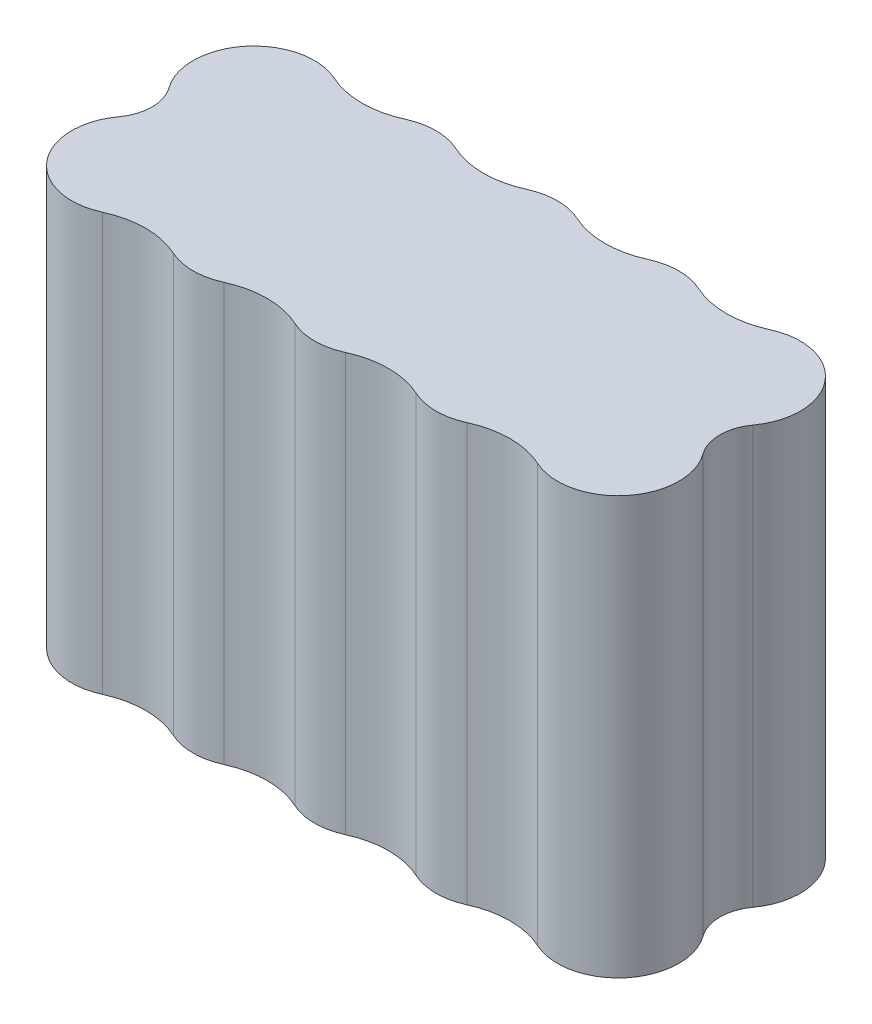
ISO-10303-21;
HEADER;
FILE_DESCRIPTION(('STEP AP214'),'2;1');
FILE_NAME('part.step','',(''),(''),'','','');
FILE_SCHEMA(('AUTOMOTIVE_DESIGN { 1 0 10303 214 1 1 1 1 }'));
ENDSEC;
DATA;
#1=APPLICATION_CONTEXT('core data for automotive mechanical design processes');
#2=APPLICATION_PROTOCOL_DEFINITION('international standard','automotive_design',2000,#1);
#3=PRODUCT_CONTEXT('',#1,'mechanical');
#4=PRODUCT('Part','Part','',(#3));
#5=PRODUCT_RELATED_PRODUCT_CATEGORY('part','',(#4));
#6=PRODUCT_DEFINITION_FORMATION('','',#4);
#7=PRODUCT_DEFINITION_CONTEXT('part definition',#1,'design');
#8=PRODUCT_DEFINITION('design','',#6,#7);
#9=PRODUCT_DEFINITION_SHAPE('','',#8);
#10=(LENGTH_UNIT() NAMED_UNIT(*) SI_UNIT(.MILLI.,.METRE.));
#11=(NAMED_UNIT(*) PLANE_ANGLE_UNIT() SI_UNIT($,.RADIAN.));
#12=(NAMED_UNIT(*) SI_UNIT($,.STERADIAN.) SOLID_ANGLE_UNIT());
#13=UNCERTAINTY_MEASURE_WITH_UNIT(LENGTH_MEASURE(1.E-05),#10,'distance_accuracy_value','');
#14=(GEOMETRIC_REPRESENTATION_CONTEXT(3) GLOBAL_UNCERTAINTY_ASSIGNED_CONTEXT((#13)) GLOBAL_UNIT_ASSIGNED_CONTEXT((#10,
#11,#12)) REPRESENTATION_CONTEXT('',''));
#15=CARTESIAN_POINT('',(0.,0.,0.));
#16=DIRECTION('',(0.,0.,1.));
#17=DIRECTION('',(1.,0.,0.));
#18=AXIS2_PLACEMENT_3D('',#15,#16,#17);
#19=CARTESIAN_POINT('',(-81.9842100959812,49.,7.125));
#20=DIRECTION('',(0.,-1.,0.));
#21=DIRECTION('',(0.,0.,-1.));
#22=AXIS2_PLACEMENT_3D('',#19,#20,#21);
#23=CYLINDRICAL_SURFACE('',#22,7.125);
#24=CARTESIAN_POINT('',(-81.9842100959812,49.,7.125));
#25=DIRECTION('',(0.,1.,0.));
#26=DIRECTION('',(0.,0.,-1.));
#27=AXIS2_PLACEMENT_3D('',#24,#25,#26);
#28=CIRCLE('',#27,7.125);
#29=CARTESIAN_POINT('',(-87.749265568197,49.,2.9381443298969));
#30=VERTEX_POINT('',#29);
#31=CARTESIAN_POINT('',(-79.0197940375871,49.,13.6040325228953));
#32=VERTEX_POINT('',#31);
#33=EDGE_CURVE('E210',#30,#32,#28,.T.);
#34=ORIENTED_EDGE('',*,*,#33,.F.);
#35=DIRECTION('',(0.,-1.,0.));
#36=VECTOR('',#35,1.);
#37=CARTESIAN_POINT('',(-87.749265568197,49.,2.9381443298969));
#38=LINE('',#37,#36);
#39=CARTESIAN_POINT('',(-87.749265568197,0.,2.9381443298969));
#40=VERTEX_POINT('',#39);
#41=EDGE_CURVE('E281',#30,#40,#38,.T.);
#42=ORIENTED_EDGE('',*,*,#41,.T.);
#43=CARTESIAN_POINT('',(-81.9842100959812,0.,7.125));
#44=DIRECTION('',(0.,1.,0.));
#45=DIRECTION('',(0.,0.,-1.));
#46=AXIS2_PLACEMENT_3D('',#43,#44,#45);
#47=CIRCLE('',#46,7.125);
#48=CARTESIAN_POINT('',(-79.0197940375871,0.,13.6040325228953));
#49=VERTEX_POINT('',#48);
#50=EDGE_CURVE('E318',#40,#49,#47,.T.);
#51=ORIENTED_EDGE('',*,*,#50,.T.);
#52=DIRECTION('',(0.,-1.,0.));
#53=VECTOR('',#52,1.);
#54=CARTESIAN_POINT('',(-79.0197940375871,49.,13.6040325228953));
#55=LINE('',#54,#53);
#56=EDGE_CURVE('E181',#49,#32,#55,.F.);
#57=ORIENTED_EDGE('',*,*,#56,.T.);
#58=EDGE_LOOP('',(#34,#42,#51,#57));
#59=FACE_BOUND('',#58,.T.);
#60=ADVANCED_FACE('F33',(#59),#23,.T.);
#61=CARTESIAN_POINT('',(-67.7342100959812,49.,7.125));
#62=DIRECTION('',(0.,-1.,0.));
#63=DIRECTION('',(0.,0.,-1.));
#64=AXIS2_PLACEMENT_3D('',#61,#62,#63);
#65=CYLINDRICAL_SURFACE('',#64,7.12499999999999);
#66=CARTESIAN_POINT('',(-67.7342100959812,0.,7.125));
#67=DIRECTION('',(0.,1.,0.));
#68=DIRECTION('',(0.,0.,-1.));
#69=AXIS2_PLACEMENT_3D('',#66,#67,#68);
#70=CIRCLE('',#69,7.12499999999999);
#71=CARTESIAN_POINT('',(-70.6986261543754,0.,13.6040325228953));
#72=VERTEX_POINT('',#71);
#73=CARTESIAN_POINT('',(-64.7697940375871,0.,13.6040325228953));
#74=VERTEX_POINT('',#73);
#75=EDGE_CURVE('E315',#72,#74,#70,.T.);
#76=ORIENTED_EDGE('',*,*,#75,.T.);
#77=DIRECTION('',(0.,-1.,0.));
#78=VECTOR('',#77,1.);
#79=CARTESIAN_POINT('',(-64.7697940375871,49.,13.6040325228953));
#80=LINE('',#79,#78);
#81=CARTESIAN_POINT('',(-64.7697940375871,49.,13.6040325228953));
#82=VERTEX_POINT('',#81);
#83=EDGE_CURVE('E243',#74,#82,#80,.F.);
#84=ORIENTED_EDGE('',*,*,#83,.T.);
#85=CARTESIAN_POINT('',(-67.7342100959812,49.,7.125));
#86=DIRECTION('',(0.,1.,0.));
#87=DIRECTION('',(0.,0.,-1.));
#88=AXIS2_PLACEMENT_3D('',#85,#86,#87);
#89=CIRCLE('',#88,7.12499999999999);
#90=CARTESIAN_POINT('',(-70.6986261543754,49.,13.6040325228953));
#91=VERTEX_POINT('',#90);
#92=EDGE_CURVE('E335',#91,#82,#89,.T.);
#93=ORIENTED_EDGE('',*,*,#92,.F.);
#94=DIRECTION('',(0.,-1.,0.));
#95=VECTOR('',#94,1.);
#96=CARTESIAN_POINT('',(-70.6986261543754,49.,13.6040325228953));
#97=LINE('',#96,#95);
#98=EDGE_CURVE('E240',#91,#72,#97,.T.);
#99=ORIENTED_EDGE('',*,*,#98,.T.);
#100=EDGE_LOOP('',(#76,#84,#93,#99));
#101=FACE_BOUND('',#100,.T.);
#102=ADVANCED_FACE('F350',(#101),#65,.T.);
#103=CARTESIAN_POINT('',(-53.4842100959812,49.,7.125));
#104=DIRECTION('',(0.,-1.,0.));
#105=DIRECTION('',(0.,0.,-1.));
#106=AXIS2_PLACEMENT_3D('',#103,#104,#105);
#107=CYLINDRICAL_SURFACE('',#106,7.125);
#108=CARTESIAN_POINT('',(-53.4842100959812,0.,7.125));
#109=DIRECTION('',(0.,1.,0.));
#110=DIRECTION('',(0.,0.,-1.));
#111=AXIS2_PLACEMENT_3D('',#108,#109,#110);
#112=CIRCLE('',#111,7.125);
#113=CARTESIAN_POINT('',(-56.4486261543754,0.,13.6040325228953));
#114=VERTEX_POINT('',#113);
#115=CARTESIAN_POINT('',(-50.5197940375871,0.,13.6040325228953));
#116=VERTEX_POINT('',#115);
#117=EDGE_CURVE('E310',#114,#116,#112,.T.);
#118=ORIENTED_EDGE('',*,*,#117,.T.);
#119=DIRECTION('',(0.,-1.,0.));
#120=VECTOR('',#119,1.);
#121=CARTESIAN_POINT('',(-50.5197940375871,49.,13.6040325228953));
#122=LINE('',#121,#120);
#123=CARTESIAN_POINT('',(-50.5197940375871,49.,13.6040325228953));
#124=VERTEX_POINT('',#123);
#125=EDGE_CURVE('E238',#116,#124,#122,.F.);
#126=ORIENTED_EDGE('',*,*,#125,.T.);
#127=CARTESIAN_POINT('',(-53.4842100959812,49.,7.125));
#128=DIRECTION('',(0.,1.,0.));
#129=DIRECTION('',(0.,0.,-1.));
#130=AXIS2_PLACEMENT_3D('',#127,#128,#129);
#131=CIRCLE('',#130,7.125);
#132=CARTESIAN_POINT('',(-56.4486261543754,49.,13.6040325228953));
#133=VERTEX_POINT('',#132);
#134=EDGE_CURVE('E332',#133,#124,#131,.T.);
#135=ORIENTED_EDGE('',*,*,#134,.F.);
#136=DIRECTION('',(0.,-1.,0.));
#137=VECTOR('',#136,1.);
#138=CARTESIAN_POINT('',(-56.4486261543754,49.,13.6040325228953));
#139=LINE('',#138,#137);
#140=EDGE_CURVE('E235',#133,#114,#139,.T.);
#141=ORIENTED_EDGE('',*,*,#140,.T.);
#142=EDGE_LOOP('',(#118,#126,#135,#141));
#143=FACE_BOUND('',#142,.T.);
#144=ADVANCED_FACE('F359',(#143),#107,.T.);
#145=CARTESIAN_POINT('',(-39.2342100959812,49.,7.125));
#146=DIRECTION('',(0.,-1.,0.));
#147=DIRECTION('',(0.,0.,-1.));
#148=AXIS2_PLACEMENT_3D('',#145,#146,#147);
#149=CYLINDRICAL_SURFACE('',#148,7.12499999999999);
#150=CARTESIAN_POINT('',(-39.2342100959812,0.,7.125));
#151=DIRECTION('',(0.,1.,0.));
#152=DIRECTION('',(0.,0.,-1.));
#153=AXIS2_PLACEMENT_3D('',#150,#151,#152);
#154=CIRCLE('',#153,7.12499999999999);
#155=CARTESIAN_POINT('',(-42.1986261543754,0.,13.6040325228953));
#156=VERTEX_POINT('',#155);
#157=CARTESIAN_POINT('',(-36.2697940375871,0.,13.6040325228953));
#158=VERTEX_POINT('',#157);
#159=EDGE_CURVE('E308',#156,#158,#154,.T.);
#160=ORIENTED_EDGE('',*,*,#159,.T.);
#161=DIRECTION('',(0.,-1.,0.));
#162=VECTOR('',#161,1.);
#163=CARTESIAN_POINT('',(-36.2697940375871,49.,13.6040325228953));
#164=LINE('',#163,#162);
#165=CARTESIAN_POINT('',(-36.2697940375871,49.,13.6040325228953));
#166=VERTEX_POINT('',#165);
#167=EDGE_CURVE('E233',#158,#166,#164,.F.);
#168=ORIENTED_EDGE('',*,*,#167,.T.);
#169=CARTESIAN_POINT('',(-39.2342100959812,49.,7.125));
#170=DIRECTION('',(0.,1.,0.));
#171=DIRECTION('',(0.,0.,-1.));
#172=AXIS2_PLACEMENT_3D('',#169,#170,#171);
#173=CIRCLE('',#172,7.12499999999999);
#174=CARTESIAN_POINT('',(-42.1986261543754,49.,13.6040325228953));
#175=VERTEX_POINT('',#174);
#176=EDGE_CURVE('E329',#175,#166,#173,.T.);
#177=ORIENTED_EDGE('',*,*,#176,.F.);
#178=DIRECTION('',(0.,-1.,0.));
#179=VECTOR('',#178,1.);
#180=CARTESIAN_POINT('',(-42.1986261543754,49.,13.6040325228953));
#181=LINE('',#180,#179);
#182=EDGE_CURVE('E230',#175,#156,#181,.T.);
#183=ORIENTED_EDGE('',*,*,#182,.T.);
#184=EDGE_LOOP('',(#160,#168,#177,#183));
#185=FACE_BOUND('',#184,.T.);
#186=ADVANCED_FACE('F368',(#185),#149,.T.);
#187=CARTESIAN_POINT('',(-24.9842100959813,49.,7.125));
#188=DIRECTION('',(0.,-1.,0.));
#189=DIRECTION('',(0.,0.,-1.));
#190=AXIS2_PLACEMENT_3D('',#187,#188,#189);
#191=CYLINDRICAL_SURFACE('',#190,7.125);
#192=CARTESIAN_POINT('',(-24.9842100959813,0.,7.125));
#193=DIRECTION('',(0.,1.,0.));
#194=DIRECTION('',(0.,0.,-1.));
#195=AXIS2_PLACEMENT_3D('',#192,#193,#194);
#196=CIRCLE('',#195,7.125);
#197=CARTESIAN_POINT('',(-27.9486261543754,0.,13.6040325228953));
#198=VERTEX_POINT('',#197);
#199=CARTESIAN_POINT('',(-19.2191546237654,0.,2.93814432989693));
#200=VERTEX_POINT('',#199);
#201=EDGE_CURVE('E202',#198,#200,#196,.T.);
#202=ORIENTED_EDGE('',*,*,#201,.T.);
#203=DIRECTION('',(0.,-1.,0.));
#204=VECTOR('',#203,1.);
#205=CARTESIAN_POINT('',(-19.2191546237654,49.,2.93814432989693));
#206=LINE('',#205,#204);
#207=CARTESIAN_POINT('',(-19.2191546237654,49.,2.93814432989693));
#208=VERTEX_POINT('',#207);
#209=EDGE_CURVE('E279',#200,#208,#206,.F.);
#210=ORIENTED_EDGE('',*,*,#209,.T.);
#211=CARTESIAN_POINT('',(-24.9842100959813,49.,7.125));
#212=DIRECTION('',(0.,1.,0.));
#213=DIRECTION('',(0.,0.,-1.));
#214=AXIS2_PLACEMENT_3D('',#211,#212,#213);
#215=CIRCLE('',#214,7.125);
#216=CARTESIAN_POINT('',(-27.9486261543754,49.,13.6040325228953));
#217=VERTEX_POINT('',#216);
#218=EDGE_CURVE('E295',#217,#208,#215,.T.);
#219=ORIENTED_EDGE('',*,*,#218,.F.);
#220=DIRECTION('',(0.,-1.,0.));
#221=VECTOR('',#220,1.);
#222=CARTESIAN_POINT('',(-27.9486261543754,49.,13.6040325228953));
#223=LINE('',#222,#221);
#224=EDGE_CURVE('E227',#217,#198,#223,.T.);
#225=ORIENTED_EDGE('',*,*,#224,.T.);
#226=EDGE_LOOP('',(#202,#210,#219,#225));
#227=FACE_BOUND('',#226,.T.);
#228=ADVANCED_FACE('F306',(#227),#191,.T.);
#229=CARTESIAN_POINT('',(-24.9842100959812,49.,-7.125));
#230=DIRECTION('',(0.,-1.,0.));
#231=DIRECTION('',(0.,0.,-1.));
#232=AXIS2_PLACEMENT_3D('',#229,#230,#231);
#233=CYLINDRICAL_SURFACE('',#232,7.125);
#234=CARTESIAN_POINT('',(-24.9842100959812,49.,-7.125));
#235=DIRECTION('',(0.,1.,0.));
#236=DIRECTION('',(0.,0.,1.));
#237=AXIS2_PLACEMENT_3D('',#234,#235,#236);
#238=CIRCLE('',#237,7.125);
#239=CARTESIAN_POINT('',(-19.2191546237654,49.,-2.93814432989688));
#240=VERTEX_POINT('',#239);
#241=CARTESIAN_POINT('',(-27.9486261543754,49.,-13.6040325228953));
#242=VERTEX_POINT('',#241);
#243=EDGE_CURVE('E293',#240,#242,#238,.T.);
#244=ORIENTED_EDGE('',*,*,#243,.F.);
#245=DIRECTION('',(0.,-1.,0.));
#246=VECTOR('',#245,1.);
#247=CARTESIAN_POINT('',(-19.2191546237654,49.,-2.93814432989688));
#248=LINE('',#247,#246);
#249=CARTESIAN_POINT('',(-19.2191546237654,0.,-2.93814432989688));
#250=VERTEX_POINT('',#249);
#251=EDGE_CURVE('E276',#240,#250,#248,.T.);
#252=ORIENTED_EDGE('',*,*,#251,.T.);
#253=CARTESIAN_POINT('',(-24.9842100959812,0.,-7.125));
#254=DIRECTION('',(0.,1.,0.));
#255=DIRECTION('',(0.,0.,1.));
#256=AXIS2_PLACEMENT_3D('',#253,#254,#255);
#257=CIRCLE('',#256,7.125);
#258=CARTESIAN_POINT('',(-27.9486261543754,0.,-13.6040325228953));
#259=VERTEX_POINT('',#258);
#260=EDGE_CURVE('E197',#250,#259,#257,.T.);
#261=ORIENTED_EDGE('',*,*,#260,.T.);
#262=DIRECTION('',(0.,-1.,0.));
#263=VECTOR('',#262,1.);
#264=CARTESIAN_POINT('',(-27.9486261543754,49.,-13.6040325228953));
#265=LINE('',#264,#263);
#266=EDGE_CURVE('E177',#259,#242,#265,.F.);
#267=ORIENTED_EDGE('',*,*,#266,.T.);
#268=EDGE_LOOP('',(#244,#252,#261,#267));
#269=FACE_BOUND('',#268,.T.);
#270=ADVANCED_FACE('F300',(#269),#233,.T.);
#271=CARTESIAN_POINT('',(-39.2342100959812,49.,-7.125));
#272=DIRECTION('',(0.,-1.,0.));
#273=DIRECTION('',(0.,0.,-1.));
#274=AXIS2_PLACEMENT_3D('',#271,#272,#273);
#275=CYLINDRICAL_SURFACE('',#274,7.125);
#276=CARTESIAN_POINT('',(-39.2342100959812,49.,-7.125));
#277=DIRECTION('',(0.,1.,0.));
#278=DIRECTION('',(0.,0.,1.));
#279=AXIS2_PLACEMENT_3D('',#276,#277,#278);
#280=CIRCLE('',#279,7.125);
#281=CARTESIAN_POINT('',(-36.269794037587,49.,-13.6040325228953));
#282=VERTEX_POINT('',#281);
#283=CARTESIAN_POINT('',(-42.1986261543754,49.,-13.6040325228953));
#284=VERTEX_POINT('',#283);
#285=EDGE_CURVE('E190',#282,#284,#280,.T.);
#286=ORIENTED_EDGE('',*,*,#285,.F.);
#287=DIRECTION('',(0.,-1.,0.));
#288=VECTOR('',#287,1.);
#289=CARTESIAN_POINT('',(-36.269794037587,49.,-13.6040325228953));
#290=LINE('',#289,#288);
#291=CARTESIAN_POINT('',(-36.269794037587,0.,-13.6040325228953));
#292=VERTEX_POINT('',#291);
#293=EDGE_CURVE('E175',#282,#292,#290,.T.);
#294=ORIENTED_EDGE('',*,*,#293,.T.);
#295=CARTESIAN_POINT('',(-39.2342100959812,0.,-7.125));
#296=DIRECTION('',(0.,1.,0.));
#297=DIRECTION('',(0.,0.,1.));
#298=AXIS2_PLACEMENT_3D('',#295,#296,#297);
#299=CIRCLE('',#298,7.125);
#300=CARTESIAN_POINT('',(-42.1986261543754,0.,-13.6040325228953));
#301=VERTEX_POINT('',#300);
#302=EDGE_CURVE('E187',#292,#301,#299,.T.);
#303=ORIENTED_EDGE('',*,*,#302,.T.);
#304=DIRECTION('',(0.,-1.,0.));
#305=VECTOR('',#304,1.);
#306=CARTESIAN_POINT('',(-42.1986261543754,49.,-13.6040325228953));
#307=LINE('',#306,#305);
#308=EDGE_CURVE('E191',#301,#284,#307,.F.);
#309=ORIENTED_EDGE('',*,*,#308,.T.);
#310=EDGE_LOOP('',(#286,#294,#303,#309));
#311=FACE_BOUND('',#310,.T.);
#312=ADVANCED_FACE('F186',(#311),#275,.T.);
#313=CARTESIAN_POINT('',(-53.4842100959812,49.,-7.125));
#314=DIRECTION('',(0.,-1.,0.));
#315=DIRECTION('',(0.,0.,-1.));
#316=AXIS2_PLACEMENT_3D('',#313,#314,#315);
#317=CYLINDRICAL_SURFACE('',#316,7.125);
#318=CARTESIAN_POINT('',(-53.4842100959812,49.,-7.125));
#319=DIRECTION('',(0.,1.,0.));
#320=DIRECTION('',(0.,0.,1.));
#321=AXIS2_PLACEMENT_3D('',#318,#319,#320);
#322=CIRCLE('',#321,7.125);
#323=CARTESIAN_POINT('',(-50.5197940375871,49.,-13.6040325228953));
#324=VERTEX_POINT('',#323);
#325=CARTESIAN_POINT('',(-56.4486261543754,49.,-13.6040325228953));
#326=VERTEX_POINT('',#325);
#327=EDGE_CURVE('E324',#324,#326,#322,.T.);
#328=ORIENTED_EDGE('',*,*,#327,.F.);
#329=DIRECTION('',(0.,-1.,0.));
#330=VECTOR('',#329,1.);
#331=CARTESIAN_POINT('',(-50.5197940375871,49.,-13.6040325228953));
#332=LINE('',#331,#330);
#333=CARTESIAN_POINT('',(-50.5197940375871,0.,-13.6040325228953));
#334=VERTEX_POINT('',#333);
#335=EDGE_CURVE('E216',#324,#334,#332,.T.);
#336=ORIENTED_EDGE('',*,*,#335,.T.);
#337=CARTESIAN_POINT('',(-53.4842100959812,0.,-7.125));
#338=DIRECTION('',(0.,1.,0.));
#339=DIRECTION('',(0.,0.,1.));
#340=AXIS2_PLACEMENT_3D('',#337,#338,#339);
#341=CIRCLE('',#340,7.125);
#342=CARTESIAN_POINT('',(-56.4486261543754,0.,-13.6040325228953));
#343=VERTEX_POINT('',#342);
#344=EDGE_CURVE('E196',#334,#343,#341,.T.);
#345=ORIENTED_EDGE('',*,*,#344,.T.);
#346=DIRECTION('',(0.,-1.,0.));
#347=VECTOR('',#346,1.);
#348=CARTESIAN_POINT('',(-56.4486261543754,49.,-13.6040325228953));
#349=LINE('',#348,#347);
#350=EDGE_CURVE('E214',#343,#326,#349,.F.);
#351=ORIENTED_EDGE('',*,*,#350,.T.);
#352=EDGE_LOOP('',(#328,#336,#345,#351));
#353=FACE_BOUND('',#352,.T.);
#354=ADVANCED_FACE('F415',(#353),#317,.T.);
#355=CARTESIAN_POINT('',(-67.7342100959812,49.,-7.125));
#356=DIRECTION('',(0.,-1.,0.));
#357=DIRECTION('',(0.,0.,-1.));
#358=AXIS2_PLACEMENT_3D('',#355,#356,#357);
#359=CYLINDRICAL_SURFACE('',#358,7.12499999999999);
#360=CARTESIAN_POINT('',(-67.7342100959812,49.,-7.125));
#361=DIRECTION('',(0.,1.,0.));
#362=DIRECTION('',(0.,0.,1.));
#363=AXIS2_PLACEMENT_3D('',#360,#361,#362);
#364=CIRCLE('',#363,7.12499999999999);
#365=CARTESIAN_POINT('',(-64.769794037587,49.,-13.6040325228953));
#366=VERTEX_POINT('',#365);
#367=CARTESIAN_POINT('',(-70.6986261543754,49.,-13.6040325228953));
#368=VERTEX_POINT('',#367);
#369=EDGE_CURVE('E321',#366,#368,#364,.T.);
#370=ORIENTED_EDGE('',*,*,#369,.F.);
#371=DIRECTION('',(0.,-1.,0.));
#372=VECTOR('',#371,1.);
#373=CARTESIAN_POINT('',(-64.769794037587,49.,-13.6040325228953));
#374=LINE('',#373,#372);
#375=CARTESIAN_POINT('',(-64.769794037587,0.,-13.6040325228953));
#376=VERTEX_POINT('',#375);
#377=EDGE_CURVE('E221',#366,#376,#374,.T.);
#378=ORIENTED_EDGE('',*,*,#377,.T.);
#379=CARTESIAN_POINT('',(-67.7342100959812,0.,-7.125));
#380=DIRECTION('',(0.,1.,0.));
#381=DIRECTION('',(0.,0.,1.));
#382=AXIS2_PLACEMENT_3D('',#379,#380,#381);
#383=CIRCLE('',#382,7.12499999999999);
#384=CARTESIAN_POINT('',(-70.6986261543754,0.,-13.6040325228953));
#385=VERTEX_POINT('',#384);
#386=EDGE_CURVE('E200',#376,#385,#383,.T.);
#387=ORIENTED_EDGE('',*,*,#386,.T.);
#388=DIRECTION('',(0.,-1.,0.));
#389=VECTOR('',#388,1.);
#390=CARTESIAN_POINT('',(-70.6986261543754,49.,-13.6040325228953));
#391=LINE('',#390,#389);
#392=EDGE_CURVE('E219',#385,#368,#391,.F.);
#393=ORIENTED_EDGE('',*,*,#392,.T.);
#394=EDGE_LOOP('',(#370,#378,#387,#393));
#395=FACE_BOUND('',#394,.T.);
#396=ADVANCED_FACE('F409',(#395),#359,.T.);
#397=CARTESIAN_POINT('',(-81.9842100959812,49.,-7.125));
#398=DIRECTION('',(0.,-1.,0.));
#399=DIRECTION('',(0.,0.,-1.));
#400=AXIS2_PLACEMENT_3D('',#397,#398,#399);
#401=CYLINDRICAL_SURFACE('',#400,7.125);
#402=CARTESIAN_POINT('',(-81.9842100959812,0.,-7.125));
#403=DIRECTION('',(0.,1.,0.));
#404=DIRECTION('',(0.,0.,1.));
#405=AXIS2_PLACEMENT_3D('',#402,#403,#404);
#406=CIRCLE('',#405,7.125);
#407=CARTESIAN_POINT('',(-79.019794037587,0.,-13.6040325228953));
#408=VERTEX_POINT('',#407);
#409=CARTESIAN_POINT('',(-87.749265568197,0.,-2.93814432989691));
#410=VERTEX_POINT('',#409);
#411=EDGE_CURVE('E208',#408,#410,#406,.T.);
#412=ORIENTED_EDGE('',*,*,#411,.T.);
#413=DIRECTION('',(0.,-1.,0.));
#414=VECTOR('',#413,1.);
#415=CARTESIAN_POINT('',(-87.749265568197,49.,-2.93814432989691));
#416=LINE('',#415,#414);
#417=CARTESIAN_POINT('',(-87.749265568197,49.,-2.93814432989691));
#418=VERTEX_POINT('',#417);
#419=EDGE_CURVE('E54',#410,#418,#416,.F.);
#420=ORIENTED_EDGE('',*,*,#419,.T.);
#421=CARTESIAN_POINT('',(-81.9842100959812,49.,-7.125));
#422=DIRECTION('',(0.,1.,0.));
#423=DIRECTION('',(0.,0.,1.));
#424=AXIS2_PLACEMENT_3D('',#421,#422,#423);
#425=CIRCLE('',#424,7.125);
#426=CARTESIAN_POINT('',(-79.019794037587,49.,-13.6040325228953));
#427=VERTEX_POINT('',#426);
#428=EDGE_CURVE('E211',#427,#418,#425,.T.);
#429=ORIENTED_EDGE('',*,*,#428,.F.);
#430=DIRECTION('',(0.,-1.,0.));
#431=VECTOR('',#430,1.);
#432=CARTESIAN_POINT('',(-79.019794037587,49.,-13.6040325228953));
#433=LINE('',#432,#431);
#434=EDGE_CURVE('E224',#427,#408,#433,.T.);
#435=ORIENTED_EDGE('',*,*,#434,.T.);
#436=EDGE_LOOP('',(#412,#420,#429,#435));
#437=FACE_BOUND('',#436,.T.);
#438=ADVANCED_FACE('F413',(#437),#401,.T.);
#439=CARTESIAN_POINT('',(-81.9842100959812,49.,0.));
#440=DIRECTION('',(0.,-1.,0.));
#441=DIRECTION('',(0.,0.,-1.));
#442=AXIS2_PLACEMENT_3D('',#439,#440,#441);
#443=PLANE('',#442);
#444=ORIENTED_EDGE('',*,*,#428,.T.);
#445=CARTESIAN_POINT('',(-91.7949185311555,49.,0.));
#446=DIRECTION('',(0.,-1.,0.));
#447=DIRECTION('',(0.,0.,-1.));
#448=AXIS2_PLACEMENT_3D('',#445,#446,#447);
#449=CIRCLE('',#448,5.);
#450=EDGE_CURVE('E11',#418,#30,#449,.T.);
#451=ORIENTED_EDGE('',*,*,#450,.T.);
#452=ORIENTED_EDGE('',*,*,#33,.T.);
#453=CARTESIAN_POINT('',(-74.8592100959812,49.,22.6974115023974));
#454=DIRECTION('',(0.,-1.,0.));
#455=DIRECTION('',(0.,0.,-1.));
#456=AXIS2_PLACEMENT_3D('',#453,#454,#455);
#457=CIRCLE('',#456,10.);
#458=EDGE_CURVE('E274',#32,#91,#457,.T.);
#459=ORIENTED_EDGE('',*,*,#458,.T.);
#460=ORIENTED_EDGE('',*,*,#92,.T.);
#461=CARTESIAN_POINT('',(-60.6092100959812,49.,22.6974115023974));
#462=DIRECTION('',(0.,-1.,0.));
#463=DIRECTION('',(0.,0.,-1.));
#464=AXIS2_PLACEMENT_3D('',#461,#462,#463);
#465=CIRCLE('',#464,10.);
#466=EDGE_CURVE('E269',#82,#133,#465,.T.);
#467=ORIENTED_EDGE('',*,*,#466,.T.);
#468=ORIENTED_EDGE('',*,*,#134,.T.);
#469=CARTESIAN_POINT('',(-46.3592100959812,49.,22.6974115023974));
#470=DIRECTION('',(0.,-1.,0.));
#471=DIRECTION('',(0.,0.,-1.));
#472=AXIS2_PLACEMENT_3D('',#469,#470,#471);
#473=CIRCLE('',#472,10.);
#474=EDGE_CURVE('E265',#124,#175,#473,.T.);
#475=ORIENTED_EDGE('',*,*,#474,.T.);
#476=ORIENTED_EDGE('',*,*,#176,.T.);
#477=CARTESIAN_POINT('',(-32.1092100959813,49.,22.6974115023974));
#478=DIRECTION('',(0.,-1.,0.));
#479=DIRECTION('',(0.,0.,-1.));
#480=AXIS2_PLACEMENT_3D('',#477,#478,#479);
#481=CIRCLE('',#480,10.);
#482=EDGE_CURVE('E261',#166,#217,#481,.T.);
#483=ORIENTED_EDGE('',*,*,#482,.T.);
#484=ORIENTED_EDGE('',*,*,#218,.T.);
#485=CARTESIAN_POINT('',(-15.1735016608069,49.,0.));
#486=DIRECTION('',(0.,-1.,0.));
#487=DIRECTION('',(0.,0.,-1.));
#488=AXIS2_PLACEMENT_3D('',#485,#486,#487);
#489=CIRCLE('',#488,5.);
#490=EDGE_CURVE('E287',#208,#240,#489,.T.);
#491=ORIENTED_EDGE('',*,*,#490,.T.);
#492=ORIENTED_EDGE('',*,*,#243,.T.);
#493=CARTESIAN_POINT('',(-32.1092100959812,49.,-22.6974115023974));
#494=DIRECTION('',(0.,-1.,0.));
#495=DIRECTION('',(0.,0.,-1.));
#496=AXIS2_PLACEMENT_3D('',#493,#494,#495);
#497=CIRCLE('',#496,10.);
#498=EDGE_CURVE('E180',#242,#282,#497,.T.);
#499=ORIENTED_EDGE('',*,*,#498,.T.);
#500=ORIENTED_EDGE('',*,*,#285,.T.);
#501=CARTESIAN_POINT('',(-46.3592100959812,49.,-22.6974115023974));
#502=DIRECTION('',(0.,-1.,0.));
#503=DIRECTION('',(0.,0.,-1.));
#504=AXIS2_PLACEMENT_3D('',#501,#502,#503);
#505=CIRCLE('',#504,10.);
#506=EDGE_CURVE('E249',#284,#324,#505,.T.);
#507=ORIENTED_EDGE('',*,*,#506,.T.);
#508=ORIENTED_EDGE('',*,*,#327,.T.);
#509=CARTESIAN_POINT('',(-60.6092100959812,49.,-22.6974115023974));
#510=DIRECTION('',(0.,-1.,0.));
#511=DIRECTION('',(0.,0.,-1.));
#512=AXIS2_PLACEMENT_3D('',#509,#510,#511);
#513=CIRCLE('',#512,10.);
#514=EDGE_CURVE('E253',#326,#366,#513,.T.);
#515=ORIENTED_EDGE('',*,*,#514,.T.);
#516=ORIENTED_EDGE('',*,*,#369,.T.);
#517=CARTESIAN_POINT('',(-74.8592100959812,49.,-22.6974115023974));
#518=DIRECTION('',(0.,-1.,0.));
#519=DIRECTION('',(0.,0.,-1.));
#520=AXIS2_PLACEMENT_3D('',#517,#518,#519);
#521=CIRCLE('',#520,10.);
#522=EDGE_CURVE('E257',#368,#427,#521,.T.);
#523=ORIENTED_EDGE('',*,*,#522,.T.);
#524=EDGE_LOOP('',(#444,#451,#452,#459,#460,#467,#468,#475,#476,#483,#484,#491,#492,#499,#500,
#507,#508,#515,#516,#523));
#525=FACE_BOUND('',#524,.T.);
#526=ADVANCED_FACE('F292',(#525),#443,.F.);
#527=CARTESIAN_POINT('',(-81.9842100959812,0.,0.));
#528=DIRECTION('',(0.,-1.,0.));
#529=DIRECTION('',(0.,0.,-1.));
#530=AXIS2_PLACEMENT_3D('',#527,#528,#529);
#531=PLANE('',#530);
#532=ORIENTED_EDGE('',*,*,#50,.F.);
#533=CARTESIAN_POINT('',(-91.7949185311555,0.,0.));
#534=DIRECTION('',(0.,-1.,0.));
#535=DIRECTION('',(0.,0.,-1.));
#536=AXIS2_PLACEMENT_3D('',#533,#534,#535);
#537=CIRCLE('',#536,5.);
#538=EDGE_CURVE('E41',#40,#410,#537,.F.);
#539=ORIENTED_EDGE('',*,*,#538,.T.);
#540=ORIENTED_EDGE('',*,*,#411,.F.);
#541=CARTESIAN_POINT('',(-74.8592100959812,0.,-22.6974115023974));
#542=DIRECTION('',(0.,-1.,0.));
#543=DIRECTION('',(0.,0.,-1.));
#544=AXIS2_PLACEMENT_3D('',#541,#542,#543);
#545=CIRCLE('',#544,10.);
#546=EDGE_CURVE('E255',#408,#385,#545,.F.);
#547=ORIENTED_EDGE('',*,*,#546,.T.);
#548=ORIENTED_EDGE('',*,*,#386,.F.);
#549=CARTESIAN_POINT('',(-60.6092100959812,0.,-22.6974115023974));
#550=DIRECTION('',(0.,-1.,0.));
#551=DIRECTION('',(0.,0.,-1.));
#552=AXIS2_PLACEMENT_3D('',#549,#550,#551);
#553=CIRCLE('',#552,10.);
#554=EDGE_CURVE('E251',#376,#343,#553,.F.);
#555=ORIENTED_EDGE('',*,*,#554,.T.);
#556=ORIENTED_EDGE('',*,*,#344,.F.);
#557=CARTESIAN_POINT('',(-46.3592100959812,0.,-22.6974115023974));
#558=DIRECTION('',(0.,-1.,0.));
#559=DIRECTION('',(0.,0.,-1.));
#560=AXIS2_PLACEMENT_3D('',#557,#558,#559);
#561=CIRCLE('',#560,10.);
#562=EDGE_CURVE('E195',#334,#301,#561,.F.);
#563=ORIENTED_EDGE('',*,*,#562,.T.);
#564=ORIENTED_EDGE('',*,*,#302,.F.);
#565=CARTESIAN_POINT('',(-32.1092100959812,0.,-22.6974115023974));
#566=DIRECTION('',(0.,-1.,0.));
#567=DIRECTION('',(0.,0.,-1.));
#568=AXIS2_PLACEMENT_3D('',#565,#566,#567);
#569=CIRCLE('',#568,10.);
#570=EDGE_CURVE('E171',#292,#259,#569,.F.);
#571=ORIENTED_EDGE('',*,*,#570,.T.);
#572=ORIENTED_EDGE('',*,*,#260,.F.);
#573=CARTESIAN_POINT('',(-15.1735016608069,0.,0.));
#574=DIRECTION('',(0.,-1.,0.));
#575=DIRECTION('',(0.,0.,-1.));
#576=AXIS2_PLACEMENT_3D('',#573,#574,#575);
#577=CIRCLE('',#576,5.);
#578=EDGE_CURVE('E285',#250,#200,#577,.F.);
#579=ORIENTED_EDGE('',*,*,#578,.T.);
#580=ORIENTED_EDGE('',*,*,#201,.F.);
#581=CARTESIAN_POINT('',(-32.1092100959813,0.,22.6974115023974));
#582=DIRECTION('',(0.,-1.,0.));
#583=DIRECTION('',(0.,0.,-1.));
#584=AXIS2_PLACEMENT_3D('',#581,#582,#583);
#585=CIRCLE('',#584,10.);
#586=EDGE_CURVE('E259',#198,#158,#585,.F.);
#587=ORIENTED_EDGE('',*,*,#586,.T.);
#588=ORIENTED_EDGE('',*,*,#159,.F.);
#589=CARTESIAN_POINT('',(-46.3592100959812,0.,22.6974115023974));
#590=DIRECTION('',(0.,-1.,0.));
#591=DIRECTION('',(0.,0.,-1.));
#592=AXIS2_PLACEMENT_3D('',#589,#590,#591);
#593=CIRCLE('',#592,10.);
#594=EDGE_CURVE('E263',#156,#116,#593,.F.);
#595=ORIENTED_EDGE('',*,*,#594,.T.);
#596=ORIENTED_EDGE('',*,*,#117,.F.);
#597=CARTESIAN_POINT('',(-60.6092100959812,0.,22.6974115023974));
#598=DIRECTION('',(0.,-1.,0.));
#599=DIRECTION('',(0.,0.,-1.));
#600=AXIS2_PLACEMENT_3D('',#597,#598,#599);
#601=CIRCLE('',#600,10.);
#602=EDGE_CURVE('E267',#114,#74,#601,.F.);
#603=ORIENTED_EDGE('',*,*,#602,.T.);
#604=ORIENTED_EDGE('',*,*,#75,.F.);
#605=CARTESIAN_POINT('',(-74.8592100959812,0.,22.6974115023974));
#606=DIRECTION('',(0.,-1.,0.));
#607=DIRECTION('',(0.,0.,-1.));
#608=AXIS2_PLACEMENT_3D('',#605,#606,#607);
#609=CIRCLE('',#608,10.);
#610=EDGE_CURVE('E271',#72,#49,#609,.F.);
#611=ORIENTED_EDGE('',*,*,#610,.T.);
#612=EDGE_LOOP('',(#532,#539,#540,#547,#548,#555,#556,#563,#564,#571,#572,#579,#580,#587,#588,
#595,#596,#603,#604,#611));
#613=FACE_BOUND('',#612,.T.);
#614=ADVANCED_FACE('F193',(#613),#531,.T.);
#615=CARTESIAN_POINT('',(-32.1092100959812,49.,-22.6974115023974));
#616=DIRECTION('',(0.,1.,0.));
#617=DIRECTION('',(0.,0.,1.));
#618=AXIS2_PLACEMENT_3D('',#615,#616,#617);
#619=CYLINDRICAL_SURFACE('',#618,10.);
#620=ORIENTED_EDGE('',*,*,#498,.F.);
#621=ORIENTED_EDGE('',*,*,#266,.F.);
#622=ORIENTED_EDGE('',*,*,#570,.F.);
#623=ORIENTED_EDGE('',*,*,#293,.F.);
#624=EDGE_LOOP('',(#620,#621,#622,#623));
#625=FACE_BOUND('',#624,.T.);
#626=ADVANCED_FACE('F174',(#625),#619,.F.);
#627=CARTESIAN_POINT('',(-46.3592100959812,49.,-22.6974115023974));
#628=DIRECTION('',(0.,1.,0.));
#629=DIRECTION('',(0.,0.,1.));
#630=AXIS2_PLACEMENT_3D('',#627,#628,#629);
#631=CYLINDRICAL_SURFACE('',#630,10.);
#632=ORIENTED_EDGE('',*,*,#506,.F.);
#633=ORIENTED_EDGE('',*,*,#308,.F.);
#634=ORIENTED_EDGE('',*,*,#562,.F.);
#635=ORIENTED_EDGE('',*,*,#335,.F.);
#636=EDGE_LOOP('',(#632,#633,#634,#635));
#637=FACE_BOUND('',#636,.T.);
#638=ADVANCED_FACE('F394',(#637),#631,.F.);
#639=CARTESIAN_POINT('',(-60.6092100959812,49.,-22.6974115023974));
#640=DIRECTION('',(0.,1.,0.));
#641=DIRECTION('',(0.,0.,1.));
#642=AXIS2_PLACEMENT_3D('',#639,#640,#641);
#643=CYLINDRICAL_SURFACE('',#642,10.);
#644=ORIENTED_EDGE('',*,*,#514,.F.);
#645=ORIENTED_EDGE('',*,*,#350,.F.);
#646=ORIENTED_EDGE('',*,*,#554,.F.);
#647=ORIENTED_EDGE('',*,*,#377,.F.);
#648=EDGE_LOOP('',(#644,#645,#646,#647));
#649=FACE_BOUND('',#648,.T.);
#650=ADVANCED_FACE('F381',(#649),#643,.F.);
#651=CARTESIAN_POINT('',(-74.8592100959812,49.,-22.6974115023974));
#652=DIRECTION('',(0.,1.,0.));
#653=DIRECTION('',(0.,0.,1.));
#654=AXIS2_PLACEMENT_3D('',#651,#652,#653);
#655=CYLINDRICAL_SURFACE('',#654,10.);
#656=ORIENTED_EDGE('',*,*,#522,.F.);
#657=ORIENTED_EDGE('',*,*,#392,.F.);
#658=ORIENTED_EDGE('',*,*,#546,.F.);
#659=ORIENTED_EDGE('',*,*,#434,.F.);
#660=EDGE_LOOP('',(#656,#657,#658,#659));
#661=FACE_BOUND('',#660,.T.);
#662=ADVANCED_FACE('F374',(#661),#655,.F.);
#663=CARTESIAN_POINT('',(-32.1092100959813,49.,22.6974115023974));
#664=DIRECTION('',(0.,1.,0.));
#665=DIRECTION('',(0.,0.,1.));
#666=AXIS2_PLACEMENT_3D('',#663,#664,#665);
#667=CYLINDRICAL_SURFACE('',#666,10.);
#668=ORIENTED_EDGE('',*,*,#482,.F.);
#669=ORIENTED_EDGE('',*,*,#167,.F.);
#670=ORIENTED_EDGE('',*,*,#586,.F.);
#671=ORIENTED_EDGE('',*,*,#224,.F.);
#672=EDGE_LOOP('',(#668,#669,#670,#671));
#673=FACE_BOUND('',#672,.T.);
#674=ADVANCED_FACE('F372',(#673),#667,.F.);
#675=CARTESIAN_POINT('',(-46.3592100959812,49.,22.6974115023974));
#676=DIRECTION('',(0.,1.,0.));
#677=DIRECTION('',(0.,0.,1.));
#678=AXIS2_PLACEMENT_3D('',#675,#676,#677);
#679=CYLINDRICAL_SURFACE('',#678,10.);
#680=ORIENTED_EDGE('',*,*,#474,.F.);
#681=ORIENTED_EDGE('',*,*,#125,.F.);
#682=ORIENTED_EDGE('',*,*,#594,.F.);
#683=ORIENTED_EDGE('',*,*,#182,.F.);
#684=EDGE_LOOP('',(#680,#681,#682,#683));
#685=FACE_BOUND('',#684,.T.);
#686=ADVANCED_FACE('F365',(#685),#679,.F.);
#687=CARTESIAN_POINT('',(-60.6092100959812,49.,22.6974115023974));
#688=DIRECTION('',(0.,1.,0.));
#689=DIRECTION('',(0.,0.,1.));
#690=AXIS2_PLACEMENT_3D('',#687,#688,#689);
#691=CYLINDRICAL_SURFACE('',#690,10.);
#692=ORIENTED_EDGE('',*,*,#466,.F.);
#693=ORIENTED_EDGE('',*,*,#83,.F.);
#694=ORIENTED_EDGE('',*,*,#602,.F.);
#695=ORIENTED_EDGE('',*,*,#140,.F.);
#696=EDGE_LOOP('',(#692,#693,#694,#695));
#697=FACE_BOUND('',#696,.T.);
#698=ADVANCED_FACE('F356',(#697),#691,.F.);
#699=CARTESIAN_POINT('',(-74.8592100959812,49.,22.6974115023974));
#700=DIRECTION('',(0.,1.,0.));
#701=DIRECTION('',(0.,0.,1.));
#702=AXIS2_PLACEMENT_3D('',#699,#700,#701);
#703=CYLINDRICAL_SURFACE('',#702,10.);
#704=ORIENTED_EDGE('',*,*,#458,.F.);
#705=ORIENTED_EDGE('',*,*,#56,.F.);
#706=ORIENTED_EDGE('',*,*,#610,.F.);
#707=ORIENTED_EDGE('',*,*,#98,.F.);
#708=EDGE_LOOP('',(#704,#705,#706,#707));
#709=FACE_BOUND('',#708,.T.);
#710=ADVANCED_FACE('F347',(#709),#703,.F.);
#711=CARTESIAN_POINT('',(-15.1735016608069,49.,0.));
#712=DIRECTION('',(0.,1.,0.));
#713=DIRECTION('',(0.,0.,1.));
#714=AXIS2_PLACEMENT_3D('',#711,#712,#713);
#715=CYLINDRICAL_SURFACE('',#714,5.);
#716=ORIENTED_EDGE('',*,*,#490,.F.);
#717=ORIENTED_EDGE('',*,*,#209,.F.);
#718=ORIENTED_EDGE('',*,*,#578,.F.);
#719=ORIENTED_EDGE('',*,*,#251,.F.);
#720=EDGE_LOOP('',(#716,#717,#718,#719));
#721=FACE_BOUND('',#720,.T.);
#722=ADVANCED_FACE('F302',(#721),#715,.F.);
#723=CARTESIAN_POINT('',(-91.7949185311555,49.,0.));
#724=DIRECTION('',(0.,1.,0.));
#725=DIRECTION('',(0.,0.,1.));
#726=AXIS2_PLACEMENT_3D('',#723,#724,#725);
#727=CYLINDRICAL_SURFACE('',#726,5.);
#728=ORIENTED_EDGE('',*,*,#450,.F.);
#729=ORIENTED_EDGE('',*,*,#419,.F.);
#730=ORIENTED_EDGE('',*,*,#538,.F.);
#731=ORIENTED_EDGE('',*,*,#41,.F.);
#732=EDGE_LOOP('',(#728,#729,#730,#731));
#733=FACE_BOUND('',#732,.T.);
#734=ADVANCED_FACE('F35',(#733),#727,.F.);
#735=CLOSED_SHELL('',(#60,#102,#144,#186,#228,#270,#312,#354,#396,#438,#526,#614,#626,#638,#650,
#662,#674,#686,#698,#710,#722,#734));
#736=MANIFOLD_SOLID_BREP('B2',#735);
#737=ADVANCED_BREP_SHAPE_REPRESENTATION('',(#18,#736),#14);
#738=SHAPE_DEFINITION_REPRESENTATION(#9,#737);
ENDSEC;
END-ISO-10303-21;
